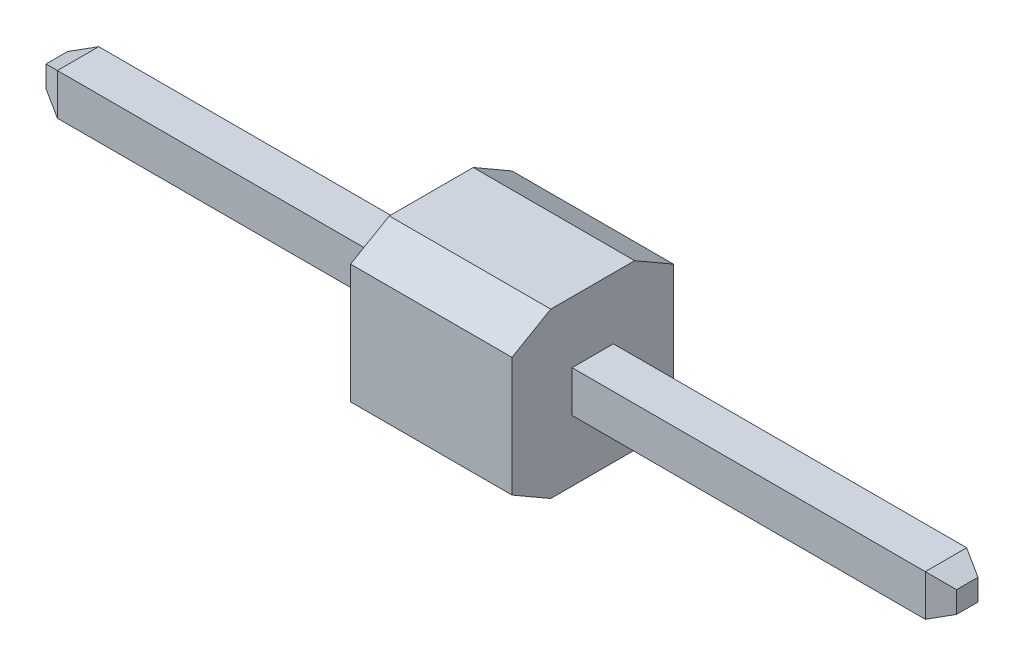
ISO-10303-21;
HEADER;
FILE_DESCRIPTION(('STEP AP214'),'2;1');
FILE_NAME('part.step','',(''),(''),'','','');
FILE_SCHEMA(('AUTOMOTIVE_DESIGN { 1 0 10303 214 1 1 1 1 }'));
ENDSEC;
DATA;
#1=APPLICATION_CONTEXT('core data for automotive mechanical design processes');
#2=APPLICATION_PROTOCOL_DEFINITION('international standard','automotive_design',2000,#1);
#3=PRODUCT_CONTEXT('',#1,'mechanical');
#4=PRODUCT('Part','Part','',(#3));
#5=PRODUCT_RELATED_PRODUCT_CATEGORY('part','',(#4));
#6=PRODUCT_DEFINITION_FORMATION('','',#4);
#7=PRODUCT_DEFINITION_CONTEXT('part definition',#1,'design');
#8=PRODUCT_DEFINITION('design','',#6,#7);
#9=PRODUCT_DEFINITION_SHAPE('','',#8);
#10=(LENGTH_UNIT() NAMED_UNIT(*) SI_UNIT(.MILLI.,.METRE.));
#11=(NAMED_UNIT(*) PLANE_ANGLE_UNIT() SI_UNIT($,.RADIAN.));
#12=(NAMED_UNIT(*) SI_UNIT($,.STERADIAN.) SOLID_ANGLE_UNIT());
#13=UNCERTAINTY_MEASURE_WITH_UNIT(LENGTH_MEASURE(1.E-05),#10,'distance_accuracy_value','');
#14=(GEOMETRIC_REPRESENTATION_CONTEXT(3) GLOBAL_UNCERTAINTY_ASSIGNED_CONTEXT((#13)) GLOBAL_UNIT_ASSIGNED_CONTEXT((#10,
#11,#12)) REPRESENTATION_CONTEXT('',''));
#15=CARTESIAN_POINT('',(0.,0.,0.));
#16=DIRECTION('',(0.,0.,1.));
#17=DIRECTION('',(1.,0.,0.));
#18=AXIS2_PLACEMENT_3D('',#15,#16,#17);
#19=CARTESIAN_POINT('',(5.42105060425137,-2.22287855189696,-2.62999803235491));
#20=DIRECTION('',(1.,-9.93476518829084E-08,4.37113882867379E-08));
#21=DIRECTION('',(-9.93476589883358E-08,-1.,8.74227765734759E-08));
#22=AXIS2_PLACEMENT_3D('',#19,#20,#21);
#23=PLANE('',#22);
#24=DIRECTION('',(-1.18186619959243E-08,-0.50000007571054,-0.866025360072933));
#25=VECTOR('',#24,1.);
#26=CARTESIAN_POINT('',(5.42105041207676,-3.46646825312919,-1.05999792363683));
#27=LINE('',#26,#25);
#28=CARTESIAN_POINT('',(5.42105041207676,-3.46646825312919,-1.05999792363683));
#29=VERTEX_POINT('',#28);
#30=CARTESIAN_POINT('',(5.42105040388855,-3.81287846709686,-1.65999789335269));
#31=VERTEX_POINT('',#30);
#32=EDGE_CURVE('E11',#29,#31,#27,.T.);
#33=ORIENTED_EDGE('',*,*,#32,.T.);
#34=DIRECTION('',(4.37113811813104E-08,-8.74227828590458E-08,-0.999999999999995));
#35=VECTOR('',#34,1.);
#36=CARTESIAN_POINT('',(5.42105040388855,-3.81287846709686,-1.65999789335269));
#37=LINE('',#36,#35);
#38=CARTESIAN_POINT('',(5.42105046071334,-3.81287858074648,-2.95999789335269));
#39=VERTEX_POINT('',#38);
#40=EDGE_CURVE('E304',#31,#39,#37,.T.);
#41=ORIENTED_EDGE('',*,*,#40,.T.);
#42=DIRECTION('',(8.75289950709518E-08,0.499999924289835,-0.866025447495714));
#43=VECTOR('',#42,1.);
#44=CARTESIAN_POINT('',(5.42105046071334,-3.81287858074648,-2.95999789335269));
#45=LINE('',#44,#43);
#46=CARTESIAN_POINT('',(5.42105052135521,-3.46646847168615,-3.55999792363683));
#47=VERTEX_POINT('',#46);
#48=EDGE_CURVE('E296',#39,#47,#45,.T.);
#49=ORIENTED_EDGE('',*,*,#48,.T.);
#50=DIRECTION('',(9.93476593246923E-08,0.999999999999991,-8.7422776482468E-08));
#51=VECTOR('',#50,1.);
#52=CARTESIAN_POINT('',(5.42105052135521,-3.46646847168615,-3.55999792363683));
#53=LINE('',#52,#51);
#54=CARTESIAN_POINT('',(5.42105070486819,-1.61928879472015,-3.55999808512241));
#55=VERTEX_POINT('',#54);
#56=EDGE_CURVE('E281',#47,#55,#53,.T.);
#57=ORIENTED_EDGE('',*,*,#56,.T.);
#58=DIRECTION('',(-1.18186619958731E-08,-0.500000075710537,-0.866025360072935));
#59=VECTOR('',#58,1.);
#60=CARTESIAN_POINT('',(5.4210507130564,-1.27287858074648,-2.95999811540655));
#61=LINE('',#60,#59);
#62=CARTESIAN_POINT('',(5.4210507130564,-1.27287858074648,-2.95999811540655));
#63=VERTEX_POINT('',#62);
#64=EDGE_CURVE('E265',#63,#55,#61,.T.);
#65=ORIENTED_EDGE('',*,*,#64,.F.);
#66=DIRECTION('',(4.37113811813104E-08,-8.74227828590458E-08,-0.999999999999995));
#67=VECTOR('',#66,1.);
#68=CARTESIAN_POINT('',(5.4210506562316,-1.27287846709686,-1.65999811540655));
#69=LINE('',#68,#67);
#70=CARTESIAN_POINT('',(5.4210506562316,-1.27287846709686,-1.65999811540655));
#71=VERTEX_POINT('',#70);
#72=EDGE_CURVE('E248',#71,#63,#69,.T.);
#73=ORIENTED_EDGE('',*,*,#72,.F.);
#74=DIRECTION('',(8.75289950705729E-08,0.499999924289834,-0.866025447495714));
#75=VECTOR('',#74,1.);
#76=CARTESIAN_POINT('',(5.42105059558973,-1.61928857616319,-1.05999808512241));
#77=LINE('',#76,#75);
#78=CARTESIAN_POINT('',(5.42105059558973,-1.61928857616319,-1.05999808512241));
#79=VERTEX_POINT('',#78);
#80=EDGE_CURVE('E242',#79,#71,#77,.T.);
#81=ORIENTED_EDGE('',*,*,#80,.F.);
#82=DIRECTION('',(9.93476593246923E-08,0.999999999999991,-8.7422776482468E-08));
#83=VECTOR('',#82,1.);
#84=CARTESIAN_POINT('',(5.42105041207676,-3.46646825312919,-1.05999792363683));
#85=LINE('',#84,#83);
#86=EDGE_CURVE('E236',#29,#79,#85,.T.);
#87=ORIENTED_EDGE('',*,*,#86,.F.);
#88=EDGE_LOOP('',(#33,#41,#49,#57,#65,#73,#81,#87));
#89=FACE_BOUND('',#88,.T.);
#90=DIRECTION('',(-4.37113803486431E-08,8.74227829017466E-08,0.999999999999995));
#91=VECTOR('',#90,1.);
#92=CARTESIAN_POINT('',(5.42105054066886,-2.86287855189696,-2.62999797640433));
#93=LINE('',#92,#91);
#94=CARTESIAN_POINT('',(5.42105054066886,-2.86287855189696,-2.62999797640433));
#95=VERTEX_POINT('',#94);
#96=CARTESIAN_POINT('',(5.42105051269358,-2.86287849594638,-1.98999797640433));
#97=VERTEX_POINT('',#96);
#98=EDGE_CURVE('E302',#95,#97,#93,.T.);
#99=ORIENTED_EDGE('',*,*,#98,.T.);
#100=DIRECTION('',(-9.93476592658906E-08,-0.999999999999991,8.74227766567418E-08));
#101=VECTOR('',#100,1.);
#102=CARTESIAN_POINT('',(5.42105057627608,-2.22287849594638,-1.98999803235491));
#103=LINE('',#102,#101);
#104=CARTESIAN_POINT('',(5.42105057627608,-2.22287849594638,-1.98999803235491));
#105=VERTEX_POINT('',#104);
#106=EDGE_CURVE('E293',#105,#97,#103,.T.);
#107=ORIENTED_EDGE('',*,*,#106,.F.);
#108=DIRECTION('',(-4.37113803486431E-08,8.74227829017466E-08,0.999999999999995));
#109=VECTOR('',#108,1.);
#110=CARTESIAN_POINT('',(5.42105060425137,-2.22287855189696,-2.62999803235491));
#111=LINE('',#110,#109);
#112=CARTESIAN_POINT('',(5.42105060425137,-2.22287855189696,-2.62999803235491));
#113=VERTEX_POINT('',#112);
#114=EDGE_CURVE('E278',#113,#105,#111,.T.);
#115=ORIENTED_EDGE('',*,*,#114,.F.);
#116=DIRECTION('',(-9.93476592658906E-08,-0.999999999999991,8.74227766567418E-08));
#117=VECTOR('',#116,1.);
#118=CARTESIAN_POINT('',(5.42105060425137,-2.22287855189696,-2.62999803235491));
#119=LINE('',#118,#117);
#120=EDGE_CURVE('E263',#113,#95,#119,.T.);
#121=ORIENTED_EDGE('',*,*,#120,.T.);
#122=EDGE_LOOP('',(#99,#107,#115,#121));
#123=FACE_BOUND('',#122,.T.);
#124=ADVANCED_FACE('F17',(#89,#123),#23,.T.);
#125=CARTESIAN_POINT('',(2.92105060425137,-2.22287830352783,-2.62999814163338));
#126=DIRECTION('',(1.,-9.93476518829084E-08,4.37113882867379E-08));
#127=DIRECTION('',(-9.93476589883358E-08,-1.,8.74227765734759E-08));
#128=AXIS2_PLACEMENT_3D('',#125,#126,#127);
#129=PLANE('',#128);
#130=DIRECTION('',(-1.18186632778994E-08,-0.50000007571054,-0.866025360072933));
#131=VECTOR('',#130,1.);
#132=CARTESIAN_POINT('',(2.92105041207676,-3.46646800476006,-1.0599980329153));
#133=LINE('',#132,#131);
#134=CARTESIAN_POINT('',(2.92105041207676,-3.46646800476006,-1.0599980329153));
#135=VERTEX_POINT('',#134);
#136=CARTESIAN_POINT('',(2.92105040388855,-3.81287821872773,-1.65999800263116));
#137=VERTEX_POINT('',#136);
#138=EDGE_CURVE('E24',#135,#137,#133,.T.);
#139=ORIENTED_EDGE('',*,*,#138,.F.);
#140=DIRECTION('',(9.93476588438628E-08,0.999999999999991,-8.7422776482468E-08));
#141=VECTOR('',#140,1.);
#142=CARTESIAN_POINT('',(2.92105041207676,-3.46646800476006,-1.0599980329153));
#143=LINE('',#142,#141);
#144=CARTESIAN_POINT('',(2.92105059558973,-1.61928832779406,-1.05999819440088));
#145=VERTEX_POINT('',#144);
#146=EDGE_CURVE('E300',#135,#145,#143,.T.);
#147=ORIENTED_EDGE('',*,*,#146,.T.);
#148=DIRECTION('',(8.7528996352548E-08,0.499999924289834,-0.866025447495714));
#149=VECTOR('',#148,1.);
#150=CARTESIAN_POINT('',(2.92105059558973,-1.61928832779406,-1.05999819440088));
#151=LINE('',#150,#149);
#152=CARTESIAN_POINT('',(2.9210506562316,-1.27287821872773,-1.65999822468502));
#153=VERTEX_POINT('',#152);
#154=EDGE_CURVE('E286',#145,#153,#151,.T.);
#155=ORIENTED_EDGE('',*,*,#154,.T.);
#156=DIRECTION('',(4.37113811813104E-08,-8.74227828590458E-08,-0.999999999999995));
#157=VECTOR('',#156,1.);
#158=CARTESIAN_POINT('',(2.9210506562316,-1.27287821872773,-1.65999822468502));
#159=LINE('',#158,#157);
#160=CARTESIAN_POINT('',(2.9210507130564,-1.27287833237735,-2.95999822468502));
#161=VERTEX_POINT('',#160);
#162=EDGE_CURVE('E271',#153,#161,#159,.T.);
#163=ORIENTED_EDGE('',*,*,#162,.T.);
#164=DIRECTION('',(-1.18186632778483E-08,-0.500000075710537,-0.866025360072935));
#165=VECTOR('',#164,1.);
#166=CARTESIAN_POINT('',(2.9210507130564,-1.27287833237735,-2.95999822468502));
#167=LINE('',#166,#165);
#168=CARTESIAN_POINT('',(2.92105070486819,-1.61928854635102,-3.55999819440088));
#169=VERTEX_POINT('',#168);
#170=EDGE_CURVE('E253',#161,#169,#167,.T.);
#171=ORIENTED_EDGE('',*,*,#170,.T.);
#172=DIRECTION('',(9.93476588438628E-08,0.999999999999991,-8.7422776482468E-08));
#173=VECTOR('',#172,1.);
#174=CARTESIAN_POINT('',(2.92105052135521,-3.46646822331702,-3.5599980329153));
#175=LINE('',#174,#173);
#176=CARTESIAN_POINT('',(2.92105052135521,-3.46646822331702,-3.5599980329153));
#177=VERTEX_POINT('',#176);
#178=EDGE_CURVE('E261',#177,#169,#175,.T.);
#179=ORIENTED_EDGE('',*,*,#178,.F.);
#180=DIRECTION('',(8.75289963529269E-08,0.499999924289835,-0.866025447495714));
#181=VECTOR('',#180,1.);
#182=CARTESIAN_POINT('',(2.92105046071334,-3.81287833237735,-2.95999800263116));
#183=LINE('',#182,#181);
#184=CARTESIAN_POINT('',(2.92105046071334,-3.81287833237735,-2.95999800263116));
#185=VERTEX_POINT('',#184);
#186=EDGE_CURVE('E276',#185,#177,#183,.T.);
#187=ORIENTED_EDGE('',*,*,#186,.F.);
#188=DIRECTION('',(4.37113811813104E-08,-8.74227828590458E-08,-0.999999999999995));
#189=VECTOR('',#188,1.);
#190=CARTESIAN_POINT('',(2.92105040388855,-3.81287821872773,-1.65999800263116));
#191=LINE('',#190,#189);
#192=EDGE_CURVE('E291',#137,#185,#191,.T.);
#193=ORIENTED_EDGE('',*,*,#192,.F.);
#194=EDGE_LOOP('',(#139,#147,#155,#163,#171,#179,#187,#193));
#195=FACE_BOUND('',#194,.T.);
#196=DIRECTION('',(-9.93476585720012E-08,-0.999999999999991,8.74227766567418E-08));
#197=VECTOR('',#196,1.);
#198=CARTESIAN_POINT('',(2.92105057627608,-2.22287824757725,-1.98999814163338));
#199=LINE('',#198,#197);
#200=CARTESIAN_POINT('',(2.92105057627608,-2.22287824757725,-1.98999814163338));
#201=VERTEX_POINT('',#200);
#202=CARTESIAN_POINT('',(2.92105051269358,-2.86287824757725,-1.9899980856828));
#203=VERTEX_POINT('',#202);
#204=EDGE_CURVE('E298',#201,#203,#199,.T.);
#205=ORIENTED_EDGE('',*,*,#204,.T.);
#206=DIRECTION('',(-4.37113810425325E-08,8.74227829017466E-08,0.999999999999995));
#207=VECTOR('',#206,1.);
#208=CARTESIAN_POINT('',(2.92105054066886,-2.86287830352783,-2.6299980856828));
#209=LINE('',#208,#207);
#210=CARTESIAN_POINT('',(2.92105054066886,-2.86287830352783,-2.6299980856828));
#211=VERTEX_POINT('',#210);
#212=EDGE_CURVE('E283',#211,#203,#209,.T.);
#213=ORIENTED_EDGE('',*,*,#212,.F.);
#214=DIRECTION('',(-9.93476585720012E-08,-0.999999999999991,8.74227766567418E-08));
#215=VECTOR('',#214,1.);
#216=CARTESIAN_POINT('',(2.92105060425137,-2.22287830352783,-2.62999814163338));
#217=LINE('',#216,#215);
#218=CARTESIAN_POINT('',(2.92105060425137,-2.22287830352783,-2.62999814163338));
#219=VERTEX_POINT('',#218);
#220=EDGE_CURVE('E268',#219,#211,#217,.T.);
#221=ORIENTED_EDGE('',*,*,#220,.F.);
#222=DIRECTION('',(-4.37113810425325E-08,8.74227829017466E-08,0.999999999999995));
#223=VECTOR('',#222,1.);
#224=CARTESIAN_POINT('',(2.92105060425137,-2.22287830352783,-2.62999814163338));
#225=LINE('',#224,#223);
#226=EDGE_CURVE('E251',#219,#201,#225,.T.);
#227=ORIENTED_EDGE('',*,*,#226,.T.);
#228=EDGE_LOOP('',(#205,#213,#221,#227));
#229=FACE_BOUND('',#228,.T.);
#230=ADVANCED_FACE('F314',(#195,#229),#129,.F.);
#231=CARTESIAN_POINT('',(5.42105041207676,-3.46646825312919,-1.05999792363683));
#232=DIRECTION('',(1.07893287081065E-07,0.866025360072937,-0.500000075710535));
#233=DIRECTION('',(1.18186629566715E-08,0.500000075710542,0.866025360072941));
#234=AXIS2_PLACEMENT_3D('',#231,#232,#233);
#235=PLANE('',#234);
#236=ORIENTED_EDGE('',*,*,#138,.T.);
#237=DIRECTION('',(-0.999999999999994,9.93476518829078E-08,-4.37113883755555E-08));
#238=VECTOR('',#237,1.);
#239=CARTESIAN_POINT('',(5.42105040388855,-3.81287846709686,-1.65999789335269));
#240=LINE('',#239,#238);
#241=EDGE_CURVE('E288',#31,#137,#240,.T.);
#242=ORIENTED_EDGE('',*,*,#241,.F.);
#243=ORIENTED_EDGE('',*,*,#32,.F.);
#244=DIRECTION('',(-0.999999999999994,9.93476525934506E-08,-4.3711388109102E-08));
#245=VECTOR('',#244,1.);
#246=CARTESIAN_POINT('',(5.42105041207676,-3.46646825312919,-1.05999792363683));
#247=LINE('',#246,#245);
#248=EDGE_CURVE('E256',#29,#135,#247,.T.);
#249=ORIENTED_EDGE('',*,*,#248,.T.);
#250=EDGE_LOOP('',(#236,#242,#243,#249));
#251=FACE_BOUND('',#250,.T.);
#252=ADVANCED_FACE('F306',(#251),#235,.F.);
#253=CARTESIAN_POINT('',(5.42105040388855,-3.81287846709686,-1.65999789335269));
#254=DIRECTION('',(9.93476589883358E-08,1.,-8.74227765734759E-08));
#255=DIRECTION('',(1.,-9.93476518829084E-08,4.37113882867379E-08));
#256=AXIS2_PLACEMENT_3D('',#253,#254,#255);
#257=PLANE('',#256);
#258=ORIENTED_EDGE('',*,*,#192,.T.);
#259=DIRECTION('',(-0.999999999999994,9.93476518829078E-08,-4.37113884643734E-08));
#260=VECTOR('',#259,1.);
#261=CARTESIAN_POINT('',(5.42105046071334,-3.81287858074648,-2.95999789335269));
#262=LINE('',#261,#260);
#263=EDGE_CURVE('E273',#39,#185,#262,.T.);
#264=ORIENTED_EDGE('',*,*,#263,.F.);
#265=ORIENTED_EDGE('',*,*,#40,.F.);
#266=ORIENTED_EDGE('',*,*,#241,.T.);
#267=EDGE_LOOP('',(#258,#264,#265,#266));
#268=FACE_BOUND('',#267,.T.);
#269=ADVANCED_FACE('F311',(#268),#257,.F.);
#270=CARTESIAN_POINT('',(5.42105046071334,-3.81287858074648,-2.95999789335269));
#271=DIRECTION('',(6.41819058997377E-08,0.866025447495721,0.499999924289845));
#272=DIRECTION('',(-8.7528996031702E-08,-0.499999924289838,0.866025447495717));
#273=AXIS2_PLACEMENT_3D('',#270,#271,#272);
#274=PLANE('',#273);
#275=ORIENTED_EDGE('',*,*,#186,.T.);
#276=DIRECTION('',(-0.999999999999994,9.93476525934506E-08,-4.37113882867377E-08));
#277=VECTOR('',#276,1.);
#278=CARTESIAN_POINT('',(5.42105052135521,-3.46646847168615,-3.55999792363683));
#279=LINE('',#278,#277);
#280=EDGE_CURVE('E258',#47,#177,#279,.T.);
#281=ORIENTED_EDGE('',*,*,#280,.F.);
#282=ORIENTED_EDGE('',*,*,#48,.F.);
#283=ORIENTED_EDGE('',*,*,#263,.T.);
#284=EDGE_LOOP('',(#275,#281,#282,#283));
#285=FACE_BOUND('',#284,.T.);
#286=ADVANCED_FACE('F319',(#285),#274,.F.);
#287=CARTESIAN_POINT('',(5.42105052135521,-3.46646847168615,-3.55999792363683));
#288=DIRECTION('',(-4.37113811813106E-08,8.74227836789032E-08,1.));
#289=DIRECTION('',(-1.,9.93476518829084E-08,-4.37113882867379E-08));
#290=AXIS2_PLACEMENT_3D('',#287,#288,#289);
#291=PLANE('',#290);
#292=ORIENTED_EDGE('',*,*,#178,.T.);
#293=DIRECTION('',(-0.999999999999994,9.93476525934505E-08,-4.37113884643734E-08));
#294=VECTOR('',#293,1.);
#295=CARTESIAN_POINT('',(5.42105070486819,-1.61928879472015,-3.55999808512241));
#296=LINE('',#295,#294);
#297=EDGE_CURVE('E245',#55,#169,#296,.T.);
#298=ORIENTED_EDGE('',*,*,#297,.F.);
#299=ORIENTED_EDGE('',*,*,#56,.F.);
#300=ORIENTED_EDGE('',*,*,#280,.T.);
#301=EDGE_LOOP('',(#292,#298,#299,#300));
#302=FACE_BOUND('',#301,.T.);
#303=ADVANCED_FACE('F326',(#302),#291,.F.);
#304=CARTESIAN_POINT('',(5.4210507130564,-1.27287858074648,-2.95999811540655));
#305=DIRECTION('',(1.07893287081065E-07,0.866025360072937,-0.500000075710535));
#306=DIRECTION('',(1.18186629566715E-08,0.500000075710542,0.866025360072941));
#307=AXIS2_PLACEMENT_3D('',#304,#305,#306);
#308=PLANE('',#307);
#309=ORIENTED_EDGE('',*,*,#170,.F.);
#310=DIRECTION('',(-0.999999999999994,9.93476518829078E-08,-4.37113882867377E-08));
#311=VECTOR('',#310,1.);
#312=CARTESIAN_POINT('',(5.4210507130564,-1.27287858074648,-2.95999811540655));
#313=LINE('',#312,#311);
#314=EDGE_CURVE('E239',#63,#161,#313,.T.);
#315=ORIENTED_EDGE('',*,*,#314,.F.);
#316=ORIENTED_EDGE('',*,*,#64,.T.);
#317=ORIENTED_EDGE('',*,*,#297,.T.);
#318=EDGE_LOOP('',(#309,#315,#316,#317));
#319=FACE_BOUND('',#318,.T.);
#320=ADVANCED_FACE('F329',(#319),#308,.T.);
#321=CARTESIAN_POINT('',(5.4210506562316,-1.27287846709686,-1.65999811540655));
#322=DIRECTION('',(9.93476589883358E-08,1.,-8.74227765734759E-08));
#323=DIRECTION('',(1.,-9.93476518829084E-08,4.37113882867379E-08));
#324=AXIS2_PLACEMENT_3D('',#321,#322,#323);
#325=PLANE('',#324);
#326=ORIENTED_EDGE('',*,*,#162,.F.);
#327=DIRECTION('',(-0.999999999999994,9.93476518829078E-08,-4.37113883755555E-08));
#328=VECTOR('',#327,1.);
#329=CARTESIAN_POINT('',(5.4210506562316,-1.27287846709686,-1.65999811540655));
#330=LINE('',#329,#328);
#331=EDGE_CURVE('E233',#71,#153,#330,.T.);
#332=ORIENTED_EDGE('',*,*,#331,.F.);
#333=ORIENTED_EDGE('',*,*,#72,.T.);
#334=ORIENTED_EDGE('',*,*,#314,.T.);
#335=EDGE_LOOP('',(#326,#332,#333,#334));
#336=FACE_BOUND('',#335,.T.);
#337=ADVANCED_FACE('F333',(#336),#325,.T.);
#338=CARTESIAN_POINT('',(5.42105059558973,-1.61928857616319,-1.05999808512241));
#339=DIRECTION('',(6.41819058997377E-08,0.866025447495721,0.499999924289845));
#340=DIRECTION('',(-8.7528996031702E-08,-0.499999924289838,0.866025447495717));
#341=AXIS2_PLACEMENT_3D('',#338,#339,#340);
#342=PLANE('',#341);
#343=ORIENTED_EDGE('',*,*,#154,.F.);
#344=DIRECTION('',(-0.999999999999994,9.93476525934505E-08,-4.3711388109102E-08));
#345=VECTOR('',#344,1.);
#346=CARTESIAN_POINT('',(5.42105059558973,-1.61928857616319,-1.05999808512241));
#347=LINE('',#346,#345);
#348=EDGE_CURVE('E230',#79,#145,#347,.T.);
#349=ORIENTED_EDGE('',*,*,#348,.F.);
#350=ORIENTED_EDGE('',*,*,#80,.T.);
#351=ORIENTED_EDGE('',*,*,#331,.T.);
#352=EDGE_LOOP('',(#343,#349,#350,#351));
#353=FACE_BOUND('',#352,.T.);
#354=ADVANCED_FACE('F337',(#353),#342,.T.);
#355=CARTESIAN_POINT('',(5.42105041207676,-3.46646825312919,-1.05999792363683));
#356=DIRECTION('',(-4.37113811813106E-08,8.74227835615132E-08,1.));
#357=DIRECTION('',(-9.93476589883358E-08,-1.,8.74227764560859E-08));
#358=AXIS2_PLACEMENT_3D('',#355,#356,#357);
#359=PLANE('',#358);
#360=ORIENTED_EDGE('',*,*,#146,.F.);
#361=ORIENTED_EDGE('',*,*,#248,.F.);
#362=ORIENTED_EDGE('',*,*,#86,.T.);
#363=ORIENTED_EDGE('',*,*,#348,.T.);
#364=EDGE_LOOP('',(#360,#361,#362,#363));
#365=FACE_BOUND('',#364,.T.);
#366=ADVANCED_FACE('F339',(#365),#359,.T.);
#367=CARTESIAN_POINT('',(-2.87894939574863,-2.22287772731145,-2.62999839515943));
#368=DIRECTION('',(-1.,9.93476518829084E-08,-4.37113882867379E-08));
#369=DIRECTION('',(9.93476589883358E-08,1.,-8.74227765734759E-08));
#370=AXIS2_PLACEMENT_3D('',#367,#368,#369);
#371=PLANE('',#370);
#372=DIRECTION('',(9.93476554747621E-08,0.999999999999991,-8.74227761417747E-08));
#373=VECTOR('',#372,1.);
#374=CARTESIAN_POINT('',(-2.87894946529228,-2.70899615762262,-2.1438798798526));
#375=LINE('',#374,#373);
#376=CARTESIAN_POINT('',(-2.87894946529228,-2.70899615762262,-2.1438798798526));
#377=VERTEX_POINT('',#376);
#378=CARTESIAN_POINT('',(-2.87894943228531,-2.37675921201362,-2.14387990889768));
#379=VERTEX_POINT('',#378);
#380=EDGE_CURVE('E228',#377,#379,#375,.T.);
#381=ORIENTED_EDGE('',*,*,#380,.T.);
#382=DIRECTION('',(4.37113820547149E-08,-8.74227801493994E-08,-0.999999999999995));
#383=VECTOR('',#382,1.);
#384=CARTESIAN_POINT('',(-2.87894943228531,-2.37675921201362,-2.14387990889768));
#385=LINE('',#384,#383);
#386=CARTESIAN_POINT('',(-2.87894941776278,-2.3767592410587,-2.47611685451568));
#387=VERTEX_POINT('',#386);
#388=EDGE_CURVE('E223',#379,#387,#385,.T.);
#389=ORIENTED_EDGE('',*,*,#388,.T.);
#390=DIRECTION('',(-9.93476608214187E-08,-0.999999999999991,8.74227774784388E-08));
#391=VECTOR('',#390,1.);
#392=CARTESIAN_POINT('',(-2.87894941776278,-2.3767592410587,-2.47611685451568));
#393=LINE('',#392,#391);
#394=CARTESIAN_POINT('',(-2.87894945076974,-2.7089961866677,-2.4761168254706));
#395=VERTEX_POINT('',#394);
#396=EDGE_CURVE('E215',#387,#395,#393,.T.);
#397=ORIENTED_EDGE('',*,*,#396,.T.);
#398=DIRECTION('',(-4.37113767080584E-08,8.74227801493995E-08,0.999999999999995));
#399=VECTOR('',#398,1.);
#400=CARTESIAN_POINT('',(-2.87894945076974,-2.7089961866677,-2.4761168254706));
#401=LINE('',#400,#399);
#402=EDGE_CURVE('E207',#395,#377,#401,.T.);
#403=ORIENTED_EDGE('',*,*,#402,.T.);
#404=EDGE_LOOP('',(#381,#389,#397,#403));
#405=FACE_BOUND('',#404,.T.);
#406=ADVANCED_FACE('F341',(#405),#371,.T.);
#407=CARTESIAN_POINT('',(-2.87894939574863,-2.22287772731145,-2.62999839515943));
#408=DIRECTION('',(9.93476589883358E-08,1.,-8.74227764510112E-08));
#409=DIRECTION('',(-4.37113811813106E-08,8.74227835564385E-08,1.));
#410=AXIS2_PLACEMENT_3D('',#407,#408,#409);
#411=PLANE('',#410);
#412=DIRECTION('',(0.999999999999994,-9.93476524284799E-08,4.37113882769953E-08));
#413=VECTOR('',#412,1.);
#414=CARTESIAN_POINT('',(-2.54894939574863,-2.22287776009618,-2.62999838073467));
#415=LINE('',#414,#413);
#416=CARTESIAN_POINT('',(-2.54894939574863,-2.22287776009618,-2.62999838073467));
#417=VERTEX_POINT('',#416);
#418=EDGE_CURVE('E225',#417,#219,#415,.T.);
#419=ORIENTED_EDGE('',*,*,#418,.F.);
#420=DIRECTION('',(-4.37113803486431E-08,8.74227829017466E-08,0.999999999999995));
#421=VECTOR('',#420,1.);
#422=CARTESIAN_POINT('',(-2.54894939574863,-2.22287776009618,-2.62999838073467));
#423=LINE('',#422,#421);
#424=CARTESIAN_POINT('',(-2.54894942372392,-2.2228777041456,-1.98999838073467));
#425=VERTEX_POINT('',#424);
#426=EDGE_CURVE('E217',#417,#425,#423,.T.);
#427=ORIENTED_EDGE('',*,*,#426,.T.);
#428=DIRECTION('',(0.999999999999994,-9.934765242848E-08,4.3711388195809E-08));
#429=VECTOR('',#428,1.);
#430=CARTESIAN_POINT('',(-2.54894942372392,-2.2228777041456,-1.98999838073467));
#431=LINE('',#430,#429);
#432=EDGE_CURVE('E220',#425,#201,#431,.T.);
#433=ORIENTED_EDGE('',*,*,#432,.T.);
#434=ORIENTED_EDGE('',*,*,#226,.F.);
#435=EDGE_LOOP('',(#419,#427,#433,#434));
#436=FACE_BOUND('',#435,.T.);
#437=ADVANCED_FACE('F348',(#436),#411,.T.);
#438=CARTESIAN_POINT('',(-2.87894942372392,-2.22287767136087,-1.98999839515943));
#439=DIRECTION('',(-4.37113811813106E-08,8.74227836789032E-08,1.));
#440=DIRECTION('',(-1.,9.93476518829084E-08,-4.37113882867379E-08));
#441=AXIS2_PLACEMENT_3D('',#438,#439,#440);
#442=PLANE('',#441);
#443=ORIENTED_EDGE('',*,*,#432,.F.);
#444=DIRECTION('',(-9.93476592658906E-08,-0.999999999999991,8.74227766567418E-08));
#445=VECTOR('',#444,1.);
#446=CARTESIAN_POINT('',(-2.54894942372392,-2.2228777041456,-1.98999838073467));
#447=LINE('',#446,#445);
#448=CARTESIAN_POINT('',(-2.54894948730642,-2.8628777041456,-1.9899983247841));
#449=VERTEX_POINT('',#448);
#450=EDGE_CURVE('E209',#425,#449,#447,.T.);
#451=ORIENTED_EDGE('',*,*,#450,.T.);
#452=DIRECTION('',(0.999999999999994,-9.93476524284799E-08,4.3711388195809E-08));
#453=VECTOR('',#452,1.);
#454=CARTESIAN_POINT('',(-2.54894948730642,-2.8628777041456,-1.9899983247841));
#455=LINE('',#454,#453);
#456=EDGE_CURVE('E212',#449,#203,#455,.T.);
#457=ORIENTED_EDGE('',*,*,#456,.T.);
#458=ORIENTED_EDGE('',*,*,#204,.F.);
#459=EDGE_LOOP('',(#443,#451,#457,#458));
#460=FACE_BOUND('',#459,.T.);
#461=ADVANCED_FACE('F424',(#460),#442,.T.);
#462=CARTESIAN_POINT('',(-2.87894945933114,-2.86287772731145,-2.62999833920885));
#463=DIRECTION('',(9.93476589883357E-08,1.,-8.74227764040693E-08));
#464=DIRECTION('',(-4.37113811813106E-08,8.74227835094966E-08,1.));
#465=AXIS2_PLACEMENT_3D('',#462,#463,#464);
#466=PLANE('',#465);
#467=ORIENTED_EDGE('',*,*,#456,.F.);
#468=DIRECTION('',(4.37113817364219E-08,-8.74227829017466E-08,-0.999999999999995));
#469=VECTOR('',#468,1.);
#470=CARTESIAN_POINT('',(-2.54894948730642,-2.8628777041456,-1.9899983247841));
#471=LINE('',#470,#469);
#472=CARTESIAN_POINT('',(-2.54894945933114,-2.86287776009618,-2.6299983247841));
#473=VERTEX_POINT('',#472);
#474=EDGE_CURVE('E201',#449,#473,#471,.T.);
#475=ORIENTED_EDGE('',*,*,#474,.T.);
#476=DIRECTION('',(0.999999999999994,-9.93476524284799E-08,4.37113882769953E-08));
#477=VECTOR('',#476,1.);
#478=CARTESIAN_POINT('',(-2.54894945933114,-2.86287776009618,-2.6299983247841));
#479=LINE('',#478,#477);
#480=EDGE_CURVE('E204',#473,#211,#479,.T.);
#481=ORIENTED_EDGE('',*,*,#480,.T.);
#482=ORIENTED_EDGE('',*,*,#212,.T.);
#483=EDGE_LOOP('',(#467,#475,#481,#482));
#484=FACE_BOUND('',#483,.T.);
#485=ADVANCED_FACE('F421',(#484),#466,.F.);
#486=CARTESIAN_POINT('',(-2.87894939574863,-2.22287772731145,-2.62999839515943));
#487=DIRECTION('',(-4.37113811813106E-08,8.74227836789032E-08,1.));
#488=DIRECTION('',(-1.,9.93476518829084E-08,-4.37113882867379E-08));
#489=AXIS2_PLACEMENT_3D('',#486,#487,#488);
#490=PLANE('',#489);
#491=ORIENTED_EDGE('',*,*,#480,.F.);
#492=DIRECTION('',(9.93476578781118E-08,0.999999999999991,-8.74227766567418E-08));
#493=VECTOR('',#492,1.);
#494=CARTESIAN_POINT('',(-2.54894945933114,-2.86287776009618,-2.6299983247841));
#495=LINE('',#494,#493);
#496=EDGE_CURVE('E196',#473,#417,#495,.T.);
#497=ORIENTED_EDGE('',*,*,#496,.T.);
#498=ORIENTED_EDGE('',*,*,#418,.T.);
#499=ORIENTED_EDGE('',*,*,#220,.T.);
#500=EDGE_LOOP('',(#491,#497,#498,#499));
#501=FACE_BOUND('',#500,.T.);
#502=ADVANCED_FACE('F376',(#501),#490,.F.);
#503=CARTESIAN_POINT('',(-2.87894939574863,-2.22287772731145,-2.62999839515943));
#504=DIRECTION('',(-4.37113811813106E-08,8.74227836789032E-08,1.));
#505=DIRECTION('',(-1.,9.93476518829084E-08,-4.37113882867379E-08));
#506=AXIS2_PLACEMENT_3D('',#503,#504,#505);
#507=PLANE('',#506);
#508=DIRECTION('',(0.999999999999994,-9.93476517789893E-08,4.37113882769953E-08));
#509=VECTOR('',#508,1.);
#510=CARTESIAN_POINT('',(5.42105060425137,-2.22287855189697,-2.62999803235491));
#511=LINE('',#510,#509);
#512=CARTESIAN_POINT('',(10.8910506042514,-2.22287909532862,-2.62999779325361));
#513=VERTEX_POINT('',#512);
#514=EDGE_CURVE('E199',#113,#513,#511,.T.);
#515=ORIENTED_EDGE('',*,*,#514,.T.);
#516=DIRECTION('',(-9.93476606536693E-08,-0.999999999999991,8.74227766567418E-08));
#517=VECTOR('',#516,1.);
#518=CARTESIAN_POINT('',(10.8910506042514,-2.22287909532862,-2.62999779325361));
#519=LINE('',#518,#517);
#520=CARTESIAN_POINT('',(10.8910505406689,-2.86287909532862,-2.62999773730304));
#521=VERTEX_POINT('',#520);
#522=EDGE_CURVE('E191',#513,#521,#519,.T.);
#523=ORIENTED_EDGE('',*,*,#522,.T.);
#524=DIRECTION('',(0.999999999999994,-9.93476517789893E-08,4.37113882769953E-08));
#525=VECTOR('',#524,1.);
#526=CARTESIAN_POINT('',(5.42105054066886,-2.86287855189697,-2.62999797640433));
#527=LINE('',#526,#525);
#528=EDGE_CURVE('E194',#95,#521,#527,.T.);
#529=ORIENTED_EDGE('',*,*,#528,.F.);
#530=ORIENTED_EDGE('',*,*,#120,.F.);
#531=EDGE_LOOP('',(#515,#523,#529,#530));
#532=FACE_BOUND('',#531,.T.);
#533=ADVANCED_FACE('F367',(#532),#507,.F.);
#534=CARTESIAN_POINT('',(-2.87894945933114,-2.86287772731145,-2.62999833920885));
#535=DIRECTION('',(9.93476589883357E-08,1.,-8.74227764040693E-08));
#536=DIRECTION('',(-4.37113811813106E-08,8.74227835094966E-08,1.));
#537=AXIS2_PLACEMENT_3D('',#534,#535,#536);
#538=PLANE('',#537);
#539=ORIENTED_EDGE('',*,*,#528,.T.);
#540=DIRECTION('',(-4.37113845119794E-08,8.74227829017466E-08,0.999999999999995));
#541=VECTOR('',#540,1.);
#542=CARTESIAN_POINT('',(10.8910505406689,-2.86287909532862,-2.62999773730304));
#543=LINE('',#542,#541);
#544=CARTESIAN_POINT('',(10.8910505126936,-2.86287903937804,-1.98999773730304));
#545=VERTEX_POINT('',#544);
#546=EDGE_CURVE('E186',#521,#545,#543,.T.);
#547=ORIENTED_EDGE('',*,*,#546,.T.);
#548=DIRECTION('',(0.999999999999994,-9.93476517789893E-08,4.37113881146227E-08));
#549=VECTOR('',#548,1.);
#550=CARTESIAN_POINT('',(5.42105051269358,-2.86287849594638,-1.98999797640433));
#551=LINE('',#550,#549);
#552=EDGE_CURVE('E189',#97,#545,#551,.T.);
#553=ORIENTED_EDGE('',*,*,#552,.F.);
#554=ORIENTED_EDGE('',*,*,#98,.F.);
#555=EDGE_LOOP('',(#539,#547,#553,#554));
#556=FACE_BOUND('',#555,.T.);
#557=ADVANCED_FACE('F364',(#556),#538,.F.);
#558=CARTESIAN_POINT('',(-2.87894942372392,-2.22287767136087,-1.98999839515943));
#559=DIRECTION('',(-4.37113811813106E-08,8.74227836789032E-08,1.));
#560=DIRECTION('',(-1.,9.93476518829084E-08,-4.37113882867379E-08));
#561=AXIS2_PLACEMENT_3D('',#558,#559,#560);
#562=PLANE('',#561);
#563=ORIENTED_EDGE('',*,*,#552,.T.);
#564=DIRECTION('',(9.93476606536693E-08,0.999999999999991,-8.74227766567418E-08));
#565=VECTOR('',#564,1.);
#566=CARTESIAN_POINT('',(10.8910505126936,-2.86287903937804,-1.98999773730304));
#567=LINE('',#566,#565);
#568=CARTESIAN_POINT('',(10.8910505762761,-2.22287903937804,-1.98999779325361));
#569=VERTEX_POINT('',#568);
#570=EDGE_CURVE('E176',#545,#569,#567,.T.);
#571=ORIENTED_EDGE('',*,*,#570,.T.);
#572=DIRECTION('',(0.999999999999994,-9.93476517789893E-08,4.37113881146227E-08));
#573=VECTOR('',#572,1.);
#574=CARTESIAN_POINT('',(5.42105057627608,-2.22287849594638,-1.98999803235491));
#575=LINE('',#574,#573);
#576=EDGE_CURVE('E179',#105,#569,#575,.T.);
#577=ORIENTED_EDGE('',*,*,#576,.F.);
#578=ORIENTED_EDGE('',*,*,#106,.T.);
#579=EDGE_LOOP('',(#563,#571,#577,#578));
#580=FACE_BOUND('',#579,.T.);
#581=ADVANCED_FACE('F366',(#580),#562,.T.);
#582=CARTESIAN_POINT('',(-2.87894939574863,-2.22287772731145,-2.62999839515943));
#583=DIRECTION('',(9.93476589883358E-08,1.,-8.74227764510112E-08));
#584=DIRECTION('',(-4.37113811813106E-08,8.74227835564385E-08,1.));
#585=AXIS2_PLACEMENT_3D('',#582,#583,#584);
#586=PLANE('',#585);
#587=ORIENTED_EDGE('',*,*,#576,.T.);
#588=DIRECTION('',(4.37113789608643E-08,-8.74227829017466E-08,-0.999999999999995));
#589=VECTOR('',#588,1.);
#590=CARTESIAN_POINT('',(10.8910505762761,-2.22287903937804,-1.98999779325361));
#591=LINE('',#590,#589);
#592=EDGE_CURVE('E167',#569,#513,#591,.T.);
#593=ORIENTED_EDGE('',*,*,#592,.T.);
#594=ORIENTED_EDGE('',*,*,#514,.F.);
#595=ORIENTED_EDGE('',*,*,#114,.T.);
#596=EDGE_LOOP('',(#587,#593,#594,#595));
#597=FACE_BOUND('',#596,.T.);
#598=ADVANCED_FACE('F373',(#597),#586,.T.);
#599=CARTESIAN_POINT('',(11.2210506042514,-2.22287912811334,-2.62999777882886));
#600=DIRECTION('',(-1.,9.93476518829084E-08,-4.37113882867379E-08));
#601=DIRECTION('',(9.93476589883358E-08,1.,-8.74227765734759E-08));
#602=AXIS2_PLACEMENT_3D('',#599,#600,#601);
#603=PLANE('',#602);
#604=DIRECTION('',(-9.93476581480904E-08,-0.999999999999991,8.74227774784388E-08));
#605=VECTOR('',#604,1.);
#606=CARTESIAN_POINT('',(11.2210505677147,-2.37676061281551,-2.14387929256711));
#607=LINE('',#606,#605);
#608=CARTESIAN_POINT('',(11.2210505677147,-2.37676061281551,-2.14387929256711));
#609=VERTEX_POINT('',#608);
#610=CARTESIAN_POINT('',(11.2210505347077,-2.70899755842451,-2.14387926352203));
#611=VERTEX_POINT('',#610);
#612=EDGE_CURVE('E153',#609,#611,#607,.T.);
#613=ORIENTED_EDGE('',*,*,#612,.T.);
#614=DIRECTION('',(4.37113767080583E-08,-8.74227801493994E-08,-0.999999999999995));
#615=VECTOR('',#614,1.);
#616=CARTESIAN_POINT('',(11.2210505347077,-2.70899755842451,-2.14387926352203));
#617=LINE('',#616,#615);
#618=CARTESIAN_POINT('',(11.2210505492303,-2.70899758746959,-2.47611620914003));
#619=VERTEX_POINT('',#618);
#620=EDGE_CURVE('E395',#611,#619,#617,.T.);
#621=ORIENTED_EDGE('',*,*,#620,.T.);
#622=DIRECTION('',(9.93476581480904E-08,0.999999999999991,-8.74227761417747E-08));
#623=VECTOR('',#622,1.);
#624=CARTESIAN_POINT('',(11.2210505492303,-2.70899758746959,-2.47611620914003));
#625=LINE('',#624,#623);
#626=CARTESIAN_POINT('',(11.2210505822372,-2.37676064186059,-2.47611623818511));
#627=VERTEX_POINT('',#626);
#628=EDGE_CURVE('E156',#619,#627,#625,.T.);
#629=ORIENTED_EDGE('',*,*,#628,.T.);
#630=DIRECTION('',(-4.37113820547149E-08,8.7422774802743E-08,0.999999999999995));
#631=VECTOR('',#630,1.);
#632=CARTESIAN_POINT('',(11.2210505822372,-2.37676064186059,-2.47611623818511));
#633=LINE('',#632,#631);
#634=EDGE_CURVE('E149',#627,#609,#633,.T.);
#635=ORIENTED_EDGE('',*,*,#634,.T.);
#636=EDGE_LOOP('',(#613,#621,#629,#635));
#637=FACE_BOUND('',#636,.T.);
#638=ADVANCED_FACE('F151',(#637),#603,.F.);
#639=CARTESIAN_POINT('',(-2.87894944404337,-2.70899620012045,-2.6299983526616));
#640=DIRECTION('',(-0.422618351780369,-0.906307745050466,6.07587120833484E-08));
#641=DIRECTION('',(4.37113811813106E-08,-8.74227835094966E-08,-1.));
#642=AXIS2_PLACEMENT_3D('',#639,#640,#641);
#643=PLANE('',#642);
#644=DIRECTION('',(0.834817073788749,-0.389281669540042,0.389281691158096));
#645=VECTOR('',#644,1.);
#646=CARTESIAN_POINT('',(-2.87894946529197,-2.70899615762229,-2.14387987985293));
#647=LINE('',#646,#645);
#648=EDGE_CURVE('E181',#377,#449,#647,.T.);
#649=ORIENTED_EDGE('',*,*,#648,.F.);
#650=ORIENTED_EDGE('',*,*,#402,.F.);
#651=DIRECTION('',(-0.83481710782082,0.38928173760421,0.389281550111905));
#652=VECTOR('',#651,1.);
#653=CARTESIAN_POINT('',(-2.54894945933092,-2.86287776009594,-2.62999832478386));
#654=LINE('',#653,#652);
#655=EDGE_CURVE('E404',#473,#395,#654,.T.);
#656=ORIENTED_EDGE('',*,*,#655,.F.);
#657=ORIENTED_EDGE('',*,*,#474,.F.);
#658=EDGE_LOOP('',(#649,#650,#656,#657));
#659=FACE_BOUND('',#658,.T.);
#660=ADVANCED_FACE('F418',(#659),#643,.T.);
#661=CARTESIAN_POINT('',(-2.87894940247501,-2.2228777138587,-2.47611686796843));
#662=DIRECTION('',(-0.422618222124847,-3.72458176658199E-08,-0.906307805509828));
#663=DIRECTION('',(9.93476589883358E-08,1.,-8.74227765734759E-08));
#664=AXIS2_PLACEMENT_3D('',#661,#662,#663);
#665=PLANE('',#664);
#666=ORIENTED_EDGE('',*,*,#655,.T.);
#667=ORIENTED_EDGE('',*,*,#396,.F.);
#668=DIRECTION('',(-0.834817185169259,-0.389281503665791,0.389281618176066));
#669=VECTOR('',#668,1.);
#670=CARTESIAN_POINT('',(-2.54894939574749,-2.22287776009891,-2.62999838073494));
#671=LINE('',#670,#669);
#672=EDGE_CURVE('E160',#417,#387,#671,.T.);
#673=ORIENTED_EDGE('',*,*,#672,.F.);
#674=ORIENTED_EDGE('',*,*,#496,.F.);
#675=EDGE_LOOP('',(#666,#667,#673,#674));
#676=FACE_BOUND('',#675,.T.);
#677=ADVANCED_FACE('F434',(#676),#665,.T.);
#678=CARTESIAN_POINT('',(-2.54894942372392,-2.2228777041456,-1.98999838073467));
#679=DIRECTION('',(0.422618301356777,-1.21218081559392E-07,-0.906307768563367));
#680=DIRECTION('',(-9.93476589883358E-08,-1.,8.74227765734759E-08));
#681=AXIS2_PLACEMENT_3D('',#678,#679,#680);
#682=PLANE('',#681);
#683=ORIENTED_EDGE('',*,*,#648,.T.);
#684=ORIENTED_EDGE('',*,*,#450,.F.);
#685=DIRECTION('',(0.834817151137183,0.389281571729962,0.389281623093935));
#686=VECTOR('',#685,1.);
#687=CARTESIAN_POINT('',(-2.87894943228815,-2.37675921200608,-2.14387990889914));
#688=LINE('',#687,#686);
#689=EDGE_CURVE('E170',#379,#425,#688,.T.);
#690=ORIENTED_EDGE('',*,*,#689,.F.);
#691=ORIENTED_EDGE('',*,*,#380,.F.);
#692=EDGE_LOOP('',(#683,#684,#690,#691));
#693=FACE_BOUND('',#692,.T.);
#694=ADVANCED_FACE('F413',(#693),#682,.F.);
#695=CARTESIAN_POINT('',(-2.54894939574863,-2.22287776009618,-2.62999838073467));
#696=DIRECTION('',(0.422618171701255,-0.906307829022729,9.770517399793E-08));
#697=DIRECTION('',(-4.37113811813106E-08,8.74227835564385E-08,1.));
#698=AXIS2_PLACEMENT_3D('',#695,#696,#697);
#699=PLANE('',#698);
#700=ORIENTED_EDGE('',*,*,#672,.T.);
#701=ORIENTED_EDGE('',*,*,#388,.F.);
#702=ORIENTED_EDGE('',*,*,#689,.T.);
#703=ORIENTED_EDGE('',*,*,#426,.F.);
#704=EDGE_LOOP('',(#700,#701,#702,#703));
#705=FACE_BOUND('',#704,.T.);
#706=ADVANCED_FACE('F429',(#705),#699,.F.);
#707=CARTESIAN_POINT('',(11.2210505889636,-2.37676065531334,-2.62999776537611));
#708=DIRECTION('',(0.422618351780369,0.906307745050466,-6.07587121258922E-08));
#709=DIRECTION('',(4.37113811813106E-08,-8.74227835564385E-08,-1.));
#710=AXIS2_PLACEMENT_3D('',#707,#708,#709);
#711=PLANE('',#710);
#712=DIRECTION('',(-0.83481710782082,0.38928173760421,0.389281550111905));
#713=VECTOR('',#712,1.);
#714=CARTESIAN_POINT('',(11.2210505677173,-2.37676061280821,-2.1438792925688));
#715=LINE('',#714,#713);
#716=EDGE_CURVE('E164',#609,#569,#715,.T.);
#717=ORIENTED_EDGE('',*,*,#716,.F.);
#718=ORIENTED_EDGE('',*,*,#634,.F.);
#719=DIRECTION('',(0.834817073788748,-0.389281669540044,0.389281691158098));
#720=VECTOR('',#719,1.);
#721=CARTESIAN_POINT('',(10.8910506042514,-2.22287909532862,-2.62999779325361));
#722=LINE('',#721,#720);
#723=EDGE_CURVE('E392',#513,#627,#722,.T.);
#724=ORIENTED_EDGE('',*,*,#723,.F.);
#725=ORIENTED_EDGE('',*,*,#592,.F.);
#726=EDGE_LOOP('',(#717,#718,#724,#725));
#727=FACE_BOUND('',#726,.T.);
#728=ADVANCED_FACE('F165',(#727),#711,.T.);
#729=CARTESIAN_POINT('',(10.8910506042514,-2.22287909532862,-2.62999779325361));
#730=DIRECTION('',(-0.422618301356777,1.21218081559392E-07,0.906307768563367));
#731=DIRECTION('',(-9.93476589883358E-08,-1.,8.74227765734759E-08));
#732=AXIS2_PLACEMENT_3D('',#729,#730,#731);
#733=PLANE('',#732);
#734=ORIENTED_EDGE('',*,*,#723,.T.);
#735=ORIENTED_EDGE('',*,*,#628,.F.);
#736=DIRECTION('',(0.834817151137181,0.389281571729963,0.389281623093939));
#737=VECTOR('',#736,1.);
#738=CARTESIAN_POINT('',(10.8910505406688,-2.86287909532858,-2.62999773730289));
#739=LINE('',#738,#737);
#740=EDGE_CURVE('E389',#521,#619,#739,.T.);
#741=ORIENTED_EDGE('',*,*,#740,.F.);
#742=ORIENTED_EDGE('',*,*,#522,.F.);
#743=EDGE_LOOP('',(#734,#735,#741,#742));
#744=FACE_BOUND('',#743,.T.);
#745=ADVANCED_FACE('F390',(#744),#733,.F.);
#746=CARTESIAN_POINT('',(11.2210505830025,-2.22287908561551,-2.14387930601986));
#747=DIRECTION('',(0.422618222124847,3.72458176658199E-08,0.906307805509828));
#748=DIRECTION('',(9.93476589883358E-08,1.,-8.74227765734759E-08));
#749=AXIS2_PLACEMENT_3D('',#746,#747,#748);
#750=PLANE('',#749);
#751=ORIENTED_EDGE('',*,*,#716,.T.);
#752=ORIENTED_EDGE('',*,*,#570,.F.);
#753=DIRECTION('',(-0.834817185169259,-0.389281503665793,0.389281618176064));
#754=VECTOR('',#753,1.);
#755=CARTESIAN_POINT('',(11.2210505347074,-2.70899755842418,-2.14387926352236));
#756=LINE('',#755,#754);
#757=EDGE_CURVE('E175',#611,#545,#756,.T.);
#758=ORIENTED_EDGE('',*,*,#757,.F.);
#759=ORIENTED_EDGE('',*,*,#612,.F.);
#760=EDGE_LOOP('',(#751,#752,#758,#759));
#761=FACE_BOUND('',#760,.T.);
#762=ADVANCED_FACE('F173',(#761),#750,.T.);
#763=CARTESIAN_POINT('',(10.8910505406689,-2.86287909532862,-2.62999773730304));
#764=DIRECTION('',(-0.422618171701255,0.906307829022729,-9.77051739553862E-08));
#765=DIRECTION('',(-4.37113811813106E-08,8.74227835094966E-08,1.));
#766=AXIS2_PLACEMENT_3D('',#763,#764,#765);
#767=PLANE('',#766);
#768=ORIENTED_EDGE('',*,*,#740,.T.);
#769=ORIENTED_EDGE('',*,*,#620,.F.);
#770=ORIENTED_EDGE('',*,*,#757,.T.);
#771=ORIENTED_EDGE('',*,*,#546,.F.);
#772=EDGE_LOOP('',(#768,#769,#770,#771));
#773=FACE_BOUND('',#772,.T.);
#774=ADVANCED_FACE('F394',(#773),#767,.F.);
#775=CLOSED_SHELL('',(#124,#230,#252,#269,#286,#303,#320,#337,#354,#366,#406,#437,#461,#485,
#502,#533,#557,#581,#598,#638,#660,#677,#694,#706,#728,#745,#762,#774));
#776=MANIFOLD_SOLID_BREP('B1',#775);
#777=ADVANCED_BREP_SHAPE_REPRESENTATION('',(#18,#776),#14);
#778=SHAPE_DEFINITION_REPRESENTATION(#9,#777);
ENDSEC;
END-ISO-10303-21;
